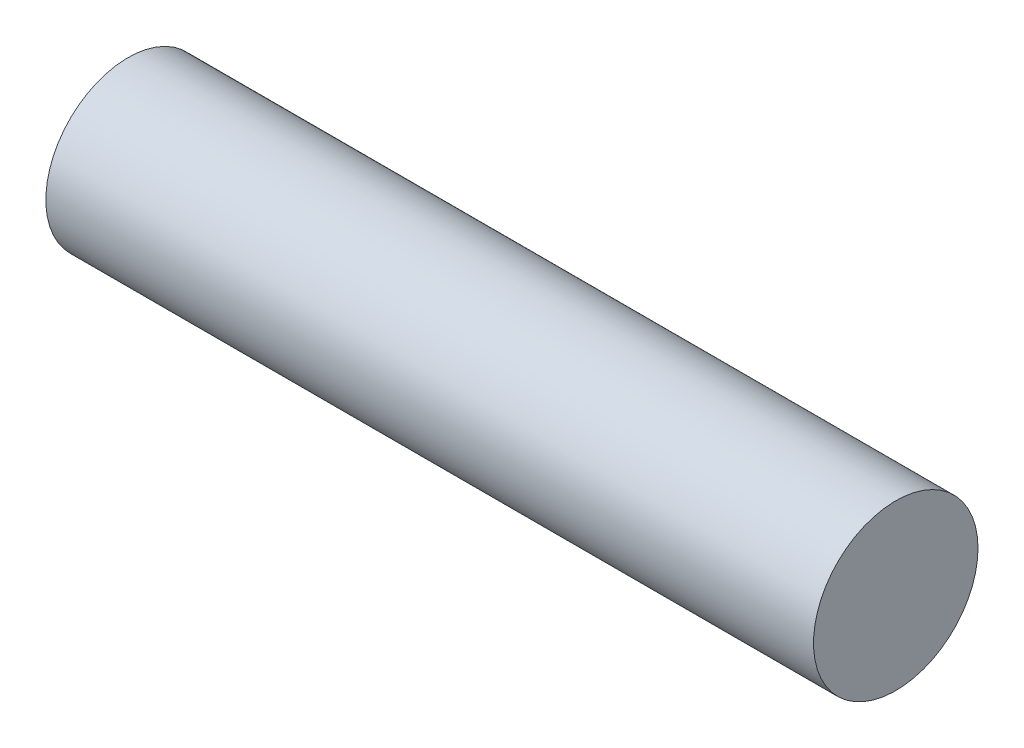
ISO-10303-21;
HEADER;
FILE_DESCRIPTION(('STEP AP214'),'2;1');
FILE_NAME('part.step','',(''),(''),'','','');
FILE_SCHEMA(('AUTOMOTIVE_DESIGN { 1 0 10303 214 1 1 1 1 }'));
ENDSEC;
DATA;
#1=APPLICATION_CONTEXT('core data for automotive mechanical design processes');
#2=APPLICATION_PROTOCOL_DEFINITION('international standard','automotive_design',2000,#1);
#3=PRODUCT_CONTEXT('',#1,'mechanical');
#4=PRODUCT('Part','Part','',(#3));
#5=PRODUCT_RELATED_PRODUCT_CATEGORY('part','',(#4));
#6=PRODUCT_DEFINITION_FORMATION('','',#4);
#7=PRODUCT_DEFINITION_CONTEXT('part definition',#1,'design');
#8=PRODUCT_DEFINITION('design','',#6,#7);
#9=PRODUCT_DEFINITION_SHAPE('','',#8);
#10=(LENGTH_UNIT() NAMED_UNIT(*) SI_UNIT(.MILLI.,.METRE.));
#11=(NAMED_UNIT(*) PLANE_ANGLE_UNIT() SI_UNIT($,.RADIAN.));
#12=(NAMED_UNIT(*) SI_UNIT($,.STERADIAN.) SOLID_ANGLE_UNIT());
#13=UNCERTAINTY_MEASURE_WITH_UNIT(LENGTH_MEASURE(1.E-05),#10,'distance_accuracy_value','');
#14=(GEOMETRIC_REPRESENTATION_CONTEXT(3) GLOBAL_UNCERTAINTY_ASSIGNED_CONTEXT((#13)) GLOBAL_UNIT_ASSIGNED_CONTEXT((#10,
#11,#12)) REPRESENTATION_CONTEXT('',''));
#15=CARTESIAN_POINT('',(0.,0.,0.));
#16=DIRECTION('',(0.,0.,1.));
#17=DIRECTION('',(1.,0.,0.));
#18=AXIS2_PLACEMENT_3D('',#15,#16,#17);
#19=CARTESIAN_POINT('',(21.,0.,0.));
#20=DIRECTION('',(-1.,0.,0.));
#21=DIRECTION('',(0.,0.,1.));
#22=AXIS2_PLACEMENT_3D('',#19,#20,#21);
#23=CYLINDRICAL_SURFACE('',#22,2.25);
#24=CARTESIAN_POINT('',(21.,0.,0.));
#25=DIRECTION('',(1.,0.,0.));
#26=DIRECTION('',(0.,0.,-1.));
#27=AXIS2_PLACEMENT_3D('',#24,#25,#26);
#28=CIRCLE('',#27,2.25);
#29=CARTESIAN_POINT('',(21.,0.,-2.25));
#30=VERTEX_POINT('',#29);
#31=EDGE_CURVE('E10',#30,#30,#28,.T.);
#32=ORIENTED_EDGE('',*,*,#31,.F.);
#33=EDGE_LOOP('',(#32));
#34=FACE_BOUND('',#33,.T.);
#35=CARTESIAN_POINT('',(0.,0.,0.));
#36=DIRECTION('',(1.,0.,0.));
#37=DIRECTION('',(0.,0.,-1.));
#38=AXIS2_PLACEMENT_3D('',#35,#36,#37);
#39=CIRCLE('',#38,2.25);
#40=CARTESIAN_POINT('',(0.,0.,-2.25));
#41=VERTEX_POINT('',#40);
#42=EDGE_CURVE('E34',#41,#41,#39,.T.);
#43=ORIENTED_EDGE('',*,*,#42,.T.);
#44=EDGE_LOOP('',(#43));
#45=FACE_BOUND('',#44,.T.);
#46=ADVANCED_FACE('F31',(#34,#45),#23,.T.);
#47=CARTESIAN_POINT('',(21.,0.,0.));
#48=DIRECTION('',(1.,0.,0.));
#49=DIRECTION('',(0.,0.,-1.));
#50=AXIS2_PLACEMENT_3D('',#47,#48,#49);
#51=PLANE('',#50);
#52=ORIENTED_EDGE('',*,*,#31,.T.);
#53=EDGE_LOOP('',(#52));
#54=FACE_BOUND('',#53,.T.);
#55=ADVANCED_FACE('F46',(#54),#51,.T.);
#56=CARTESIAN_POINT('',(0.,0.,0.));
#57=DIRECTION('',(1.,0.,0.));
#58=DIRECTION('',(0.,0.,-1.));
#59=AXIS2_PLACEMENT_3D('',#56,#57,#58);
#60=PLANE('',#59);
#61=ORIENTED_EDGE('',*,*,#42,.F.);
#62=EDGE_LOOP('',(#61));
#63=FACE_BOUND('',#62,.T.);
#64=ADVANCED_FACE('F44',(#63),#60,.F.);
#65=CLOSED_SHELL('',(#46,#55,#64));
#66=MANIFOLD_SOLID_BREP('B2',#65);
#67=ADVANCED_BREP_SHAPE_REPRESENTATION('',(#18,#66),#14);
#68=SHAPE_DEFINITION_REPRESENTATION(#9,#67);
ENDSEC;
END-ISO-10303-21;
